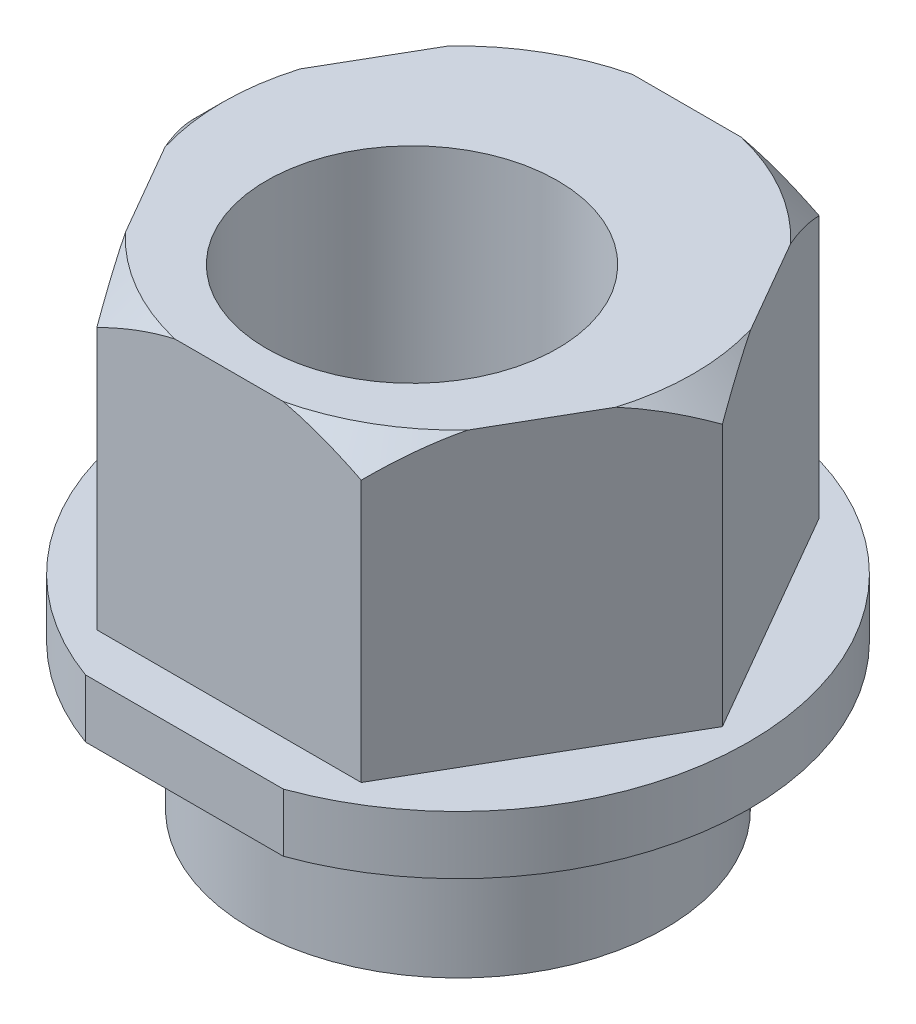
ISO-10303-21;
HEADER;
FILE_DESCRIPTION(('STEP AP214'),'2;1');
FILE_NAME('part.step','',(''),(''),'','','');
FILE_SCHEMA(('AUTOMOTIVE_DESIGN { 1 0 10303 214 1 1 1 1 }'));
ENDSEC;
DATA;
#1=APPLICATION_CONTEXT('core data for automotive mechanical design processes');
#2=APPLICATION_PROTOCOL_DEFINITION('international standard','automotive_design',2000,#1);
#3=PRODUCT_CONTEXT('',#1,'mechanical');
#4=PRODUCT('Part','Part','',(#3));
#5=PRODUCT_RELATED_PRODUCT_CATEGORY('part','',(#4));
#6=PRODUCT_DEFINITION_FORMATION('','',#4);
#7=PRODUCT_DEFINITION_CONTEXT('part definition',#1,'design');
#8=PRODUCT_DEFINITION('design','',#6,#7);
#9=PRODUCT_DEFINITION_SHAPE('','',#8);
#10=(LENGTH_UNIT() NAMED_UNIT(*) SI_UNIT(.MILLI.,.METRE.));
#11=(NAMED_UNIT(*) PLANE_ANGLE_UNIT() SI_UNIT($,.RADIAN.));
#12=(NAMED_UNIT(*) SI_UNIT($,.STERADIAN.) SOLID_ANGLE_UNIT());
#13=UNCERTAINTY_MEASURE_WITH_UNIT(LENGTH_MEASURE(1.E-05),#10,'distance_accuracy_value','');
#14=(GEOMETRIC_REPRESENTATION_CONTEXT(3) GLOBAL_UNCERTAINTY_ASSIGNED_CONTEXT((#13)) GLOBAL_UNIT_ASSIGNED_CONTEXT((#10,
#11,#12)) REPRESENTATION_CONTEXT('',''));
#15=CARTESIAN_POINT('',(0.,0.,0.));
#16=DIRECTION('',(0.,0.,1.));
#17=DIRECTION('',(1.,0.,0.));
#18=AXIS2_PLACEMENT_3D('',#15,#16,#17);
#19=CARTESIAN_POINT('',(0.,-1.,0.));
#20=DIRECTION('',(0.,1.,0.));
#21=DIRECTION('',(0.,0.,1.));
#22=AXIS2_PLACEMENT_3D('',#19,#20,#21);
#23=PLANE('',#22);
#24=CARTESIAN_POINT('',(0.,-1.,0.));
#25=DIRECTION('',(0.,1.,0.));
#26=DIRECTION('',(0.,0.,1.));
#27=AXIS2_PLACEMENT_3D('',#24,#25,#26);
#28=CIRCLE('',#27,5.);
#29=CARTESIAN_POINT('',(1.7,-1.,4.7021271782035));
#30=VERTEX_POINT('',#29);
#31=CARTESIAN_POINT('',(-1.7,-1.,4.7021271782035));
#32=VERTEX_POINT('',#31);
#33=EDGE_CURVE('E230',#30,#32,#28,.T.);
#34=ORIENTED_EDGE('',*,*,#33,.F.);
#35=DIRECTION('',(-1.,0.,0.));
#36=VECTOR('',#35,1.);
#37=CARTESIAN_POINT('',(0.,-1.,4.7021271782035));
#38=LINE('',#37,#36);
#39=EDGE_CURVE('E346',#30,#32,#38,.T.);
#40=ORIENTED_EDGE('',*,*,#39,.T.);
#41=EDGE_LOOP('',(#34,#40));
#42=FACE_BOUND('',#41,.T.);
#43=CARTESIAN_POINT('',(0.,-1.,0.));
#44=DIRECTION('',(0.,1.,0.));
#45=DIRECTION('',(0.,0.,1.));
#46=AXIS2_PLACEMENT_3D('',#43,#44,#45);
#47=CIRCLE('',#46,3.555);
#48=CARTESIAN_POINT('',(0.,-1.,3.555));
#49=VERTEX_POINT('',#48);
#50=EDGE_CURVE('E175',#49,#49,#47,.F.);
#51=ORIENTED_EDGE('',*,*,#50,.F.);
#52=EDGE_LOOP('',(#51));
#53=FACE_BOUND('',#52,.T.);
#54=ADVANCED_FACE('F43',(#42,#53),#23,.F.);
#55=CARTESIAN_POINT('',(2.27187330926118,5.,3.935));
#56=DIRECTION('',(-0.866025403784439,0.,-0.5));
#57=DIRECTION('',(-0.5,0.,0.866025403784439));
#58=AXIS2_PLACEMENT_3D('',#55,#56,#57);
#59=PLANE('',#58);
#60=DIRECTION('',(0.,-1.,0.));
#61=VECTOR('',#60,1.);
#62=CARTESIAN_POINT('',(4.54374661852235,5.,0.));
#63=LINE('',#62,#61);
#64=CARTESIAN_POINT('',(4.54374661852235,4.5,0.));
#65=VERTEX_POINT('',#64);
#66=CARTESIAN_POINT('',(4.54374661852235,0.,0.));
#67=VERTEX_POINT('',#66);
#68=EDGE_CURVE('E172',#65,#67,#63,.T.);
#69=ORIENTED_EDGE('',*,*,#68,.F.);
#70=CARTESIAN_POINT('',(6.12736327266163,2.33046829888115,-2.74290450468147));
#71=CARTESIAN_POINT('',(6.07348339276709,2.4177650828994,-2.64958181519841));
#72=CARTESIAN_POINT('',(6.01938921555573,2.50453762285222,-2.55588795187471));
#73=CARTESIAN_POINT('',(5.91069789973588,2.67683309661582,-2.36762907053321));
#74=CARTESIAN_POINT('',(5.85610071578471,2.76235591593962,-2.27306397397959));
#75=CARTESIAN_POINT('',(5.74620735938589,2.9321379387506,-2.08272309728255));
#76=CARTESIAN_POINT('',(5.6909098259844,3.01639362513631,-1.98694495989795));
#77=CARTESIAN_POINT('',(5.57966030231228,3.18315508159383,-1.79425513258));
#78=CARTESIAN_POINT('',(5.52370832991605,3.26566089928668,-1.69734347360602));
#79=CARTESIAN_POINT('',(5.40948255505868,3.43085092459455,-1.49949862801914));
#80=CARTESIAN_POINT('',(5.3511874452437,3.51347634106705,-1.3985285359868));
#81=CARTESIAN_POINT('',(5.23367321649109,3.67605365317037,-1.194987921175));
#82=CARTESIAN_POINT('',(5.17445413325307,3.75600565172091,-1.09241746022911));
#83=CARTESIAN_POINT('',(5.05499257757878,3.9125743398257,-0.885503976250002));
#84=CARTESIAN_POINT('',(4.99475102957391,3.98919384008597,-0.78116255437897));
#85=CARTESIAN_POINT('',(4.873034492307,4.1383918042904,-0.570343327711337));
#86=CARTESIAN_POINT('',(4.81155966257741,4.21097078637303,-0.463865799233039));
#87=CARTESIAN_POINT('',(4.68581480841085,4.35265115676022,-0.246069323026223));
#88=CARTESIAN_POINT('',(4.62151303943029,4.42164059850529,-0.134695392135335));
#89=CARTESIAN_POINT('',(4.4912183922476,4.55301635986169,0.090981556739347));
#90=CARTESIAN_POINT('',(4.42522527529575,4.61540174079966,0.205284988249787));
#91=CARTESIAN_POINT('',(4.29176890522431,4.73150823576122,0.436438201807242));
#92=CARTESIAN_POINT('',(4.22431561588303,4.78527468558276,0.553270726083977));
#93=CARTESIAN_POINT('',(4.08756303909753,4.88247623364584,0.790133137142428));
#94=CARTESIAN_POINT('',(4.01826431274338,4.92591443311341,0.910162052087628));
#95=CARTESIAN_POINT('',(3.89160680975576,4.99299560676046,1.129539282422));
#96=CARTESIAN_POINT('',(3.83454175212893,5.01884439579798,1.22837886156851));
#97=CARTESIAN_POINT('',(3.71955042243969,5.06126068823275,1.42754968702018));
#98=CARTESIAN_POINT('',(3.66162427680432,5.0778295405829,1.52788071434728));
#99=CARTESIAN_POINT('',(3.54536540774452,5.10083438466152,1.72924698238935));
#100=CARTESIAN_POINT('',(3.4870335640049,5.1072879053957,1.83028069944554));
#101=CARTESIAN_POINT('',(3.37031281221754,5.10976287991731,2.03244697183888));
#102=CARTESIAN_POINT('',(3.31192390350574,5.10578421082689,2.13357952832621));
#103=CARTESIAN_POINT('',(3.19571069696838,5.08764038060559,2.33486670655941));
#104=CARTESIAN_POINT('',(3.13788528988516,5.07350318473267,2.43502324959591));
#105=CARTESIAN_POINT('',(3.02300572590152,5.03579603444199,2.63400049116693));
#106=CARTESIAN_POINT('',(2.96595175572664,5.01222383709666,2.73282086628335));
#107=CARTESIAN_POINT('',(2.85271904802042,4.95661618256865,2.9289456691091));
#108=CARTESIAN_POINT('',(2.79654337792266,4.92455603960202,3.02624478386765));
#109=CARTESIAN_POINT('',(2.68537248742994,4.85318593152667,3.21879841452373));
#110=CARTESIAN_POINT('',(2.63037720983353,4.81387631861451,3.31405302949706));
#111=CARTESIAN_POINT('',(2.5019161833033,4.71383121159169,3.53655405423988));
#112=CARTESIAN_POINT('',(2.42896022795634,4.65048731772351,3.66291747561553));
#113=CARTESIAN_POINT('',(2.28511505424096,4.51496245516658,3.91206462491415));
#114=CARTESIAN_POINT('',(2.2142269607044,4.44277678394606,4.03484640457117));
#115=CARTESIAN_POINT('',(2.07416708594693,4.29140781010891,4.27743722375284));
#116=CARTESIAN_POINT('',(2.00499919286836,4.21221022636325,4.39723952881742));
#117=CARTESIAN_POINT('',(1.86828970424628,4.04847541244671,4.63402730898762));
#118=CARTESIAN_POINT('',(1.80074782327538,3.96393912900212,4.75101327846797));
#119=CARTESIAN_POINT('',(1.6667324101583,3.790255628053,4.9831347829841));
#120=CARTESIAN_POINT('',(1.60026513983173,3.70108917509827,5.09825947223014));
#121=CARTESIAN_POINT('',(1.46849790545969,3.51936003005431,5.32648701693534));
#122=CARTESIAN_POINT('',(1.40319803917282,3.42679705550268,5.43958970307165));
#123=CARTESIAN_POINT('',(1.27366225353528,3.23904020589262,5.66395226519422));
#124=CARTESIAN_POINT('',(1.20942525212282,3.14384930831284,5.77521401536649));
#125=CARTESIAN_POINT('',(1.08179181966025,2.9512386314917,5.99628160513605));
#126=CARTESIAN_POINT('',(1.01839540535985,2.85381880794148,6.10608741572204));
#127=CARTESIAN_POINT('',(0.910409016945997,2.6853578347565,6.2931253269807));
#128=CARTESIAN_POINT('',(0.865642352807006,2.61476846228915,6.3706634637548));
#129=CARTESIAN_POINT('',(0.776622094234247,2.47305833440251,6.52485107450574));
#130=CARTESIAN_POINT('',(0.732367142810404,2.40194099006958,6.60150289885833));
#131=CARTESIAN_POINT('',(0.688256655121896,2.33046829888115,6.67790450468147));
#132=B_SPLINE_CURVE_WITH_KNOTS('',3,(#70,#71,#72,#73,#74,#75,#76,#77,#78,#79,#80,#81,#82,#83,
#84,#85,#86,#87,#88,#89,#90,#91,#92,#93,#94,#95,#96,#97,#98,#99,#100,#101,#102,#103,#104,#105,
#106,#107,#108,#109,#110,#111,#112,#113,#114,#115,#116,#117,#118,#119,#120,#121,#122,#123,#124,
#125,#126,#127,#128,#129,#130,#131),.UNSPECIFIED.,.F.,.F.,(4,2,2,2,2,2,2,2,2,2,2,2,2,2,2,2,2,2,
2,2,2,2,2,2,2,2,2,2,2,2,4),(0.,0.416050988652375,0.832139855784054,1.24922530063749,
1.6662993802975,2.09496685038955,2.52361779884089,2.95189991005181,3.38012697311563,
3.81779500231414,4.25552515650994,4.69087140580247,5.12608676971888,5.4768138337239,
5.82748990199696,6.17755760407587,6.52762942952254,6.87674122143841,7.22593605499141,
7.5761578380004,7.92636261087879,8.40316579002672,8.88022366888807,9.35827656071276,
9.83624491486482,10.316388748245,10.7965726023688,11.2762330860941,11.7559031133002,
12.0979389750605,12.4385584137849),.UNSPECIFIED.);
#133=CARTESIAN_POINT('',(3.87355176865353,5.,1.1608115309438));
#134=VERTEX_POINT('',#133);
#135=EDGE_CURVE('E323',#65,#134,#132,.T.);
#136=ORIENTED_EDGE('',*,*,#135,.T.);
#137=DIRECTION('',(0.5,0.,-0.866025403784439));
#138=VECTOR('',#137,1.);
#139=CARTESIAN_POINT('',(2.27187330926118,5.,3.935));
#140=LINE('',#139,#138);
#141=CARTESIAN_POINT('',(2.94206815913,5.,2.7741884690562));
#142=VERTEX_POINT('',#141);
#143=EDGE_CURVE('E242',#142,#134,#140,.T.);
#144=ORIENTED_EDGE('',*,*,#143,.F.);
#145=CARTESIAN_POINT('',(2.27187330926118,4.5,3.935));
#146=VERTEX_POINT('',#145);
#147=EDGE_CURVE('E259',#142,#146,#132,.T.);
#148=ORIENTED_EDGE('',*,*,#147,.T.);
#149=DIRECTION('',(0.,-1.,0.));
#150=VECTOR('',#149,1.);
#151=CARTESIAN_POINT('',(2.27187330926118,5.,3.935));
#152=LINE('',#151,#150);
#153=CARTESIAN_POINT('',(2.27187330926118,0.,3.935));
#154=VERTEX_POINT('',#153);
#155=EDGE_CURVE('E226',#146,#154,#152,.T.);
#156=ORIENTED_EDGE('',*,*,#155,.T.);
#157=DIRECTION('',(0.5,0.,-0.866025403784439));
#158=VECTOR('',#157,1.);
#159=CARTESIAN_POINT('',(2.27187330926118,0.,3.935));
#160=LINE('',#159,#158);
#161=EDGE_CURVE('E227',#154,#67,#160,.T.);
#162=ORIENTED_EDGE('',*,*,#161,.T.);
#163=EDGE_LOOP('',(#69,#136,#144,#148,#156,#162));
#164=FACE_BOUND('',#163,.T.);
#165=ADVANCED_FACE('F45',(#164),#59,.F.);
#166=CARTESIAN_POINT('',(4.54374661852235,5.,0.));
#167=DIRECTION('',(-0.866025403784438,0.,0.5));
#168=DIRECTION('',(0.5,0.,0.866025403784438));
#169=AXIS2_PLACEMENT_3D('',#166,#167,#168);
#170=PLANE('',#169);
#171=DIRECTION('',(0.,-1.,0.));
#172=VECTOR('',#171,1.);
#173=CARTESIAN_POINT('',(2.27187330926118,5.,-3.935));
#174=LINE('',#173,#172);
#175=CARTESIAN_POINT('',(2.27187330926118,4.5,-3.935));
#176=VERTEX_POINT('',#175);
#177=CARTESIAN_POINT('',(2.27187330926118,0.,-3.935));
#178=VERTEX_POINT('',#177);
#179=EDGE_CURVE('E161',#176,#178,#174,.T.);
#180=ORIENTED_EDGE('',*,*,#179,.F.);
#181=CARTESIAN_POINT('',(0.688256655121894,2.33046829888116,-6.67790450468146));
#182=CARTESIAN_POINT('',(0.742136535016436,2.4177650828994,-6.58458181519841));
#183=CARTESIAN_POINT('',(0.796230712227795,2.50453762285222,-6.4908879518747));
#184=CARTESIAN_POINT('',(0.904922028047648,2.67683309661582,-6.3026290705332));
#185=CARTESIAN_POINT('',(0.959519211998818,2.76235591593963,-6.20806397397959));
#186=CARTESIAN_POINT('',(1.06941256839764,2.93213793875061,-6.01772309728255));
#187=CARTESIAN_POINT('',(1.12471010179913,3.01639362513632,-5.92194495989794));
#188=CARTESIAN_POINT('',(1.23595962547125,3.18315508159383,-5.72925513257999));
#189=CARTESIAN_POINT('',(1.29191159786749,3.26566089928668,-5.63234347360602));
#190=CARTESIAN_POINT('',(1.40613737272485,3.43085092459456,-5.43449862801913));
#191=CARTESIAN_POINT('',(1.46443248253983,3.51347634106706,-5.33352853598679));
#192=CARTESIAN_POINT('',(1.58194671129244,3.67605365317038,-5.12998792117499));
#193=CARTESIAN_POINT('',(1.64116579453046,3.75600565172092,-5.0274174602291));
#194=CARTESIAN_POINT('',(1.76062735020476,3.9125743398257,-4.82050397624999));
#195=CARTESIAN_POINT('',(1.82086889820963,3.98919384008598,-4.71616255437896));
#196=CARTESIAN_POINT('',(1.94258543547653,4.1383918042904,-4.50534332771133));
#197=CARTESIAN_POINT('',(2.00406026520612,4.21097078637303,-4.39886579923303));
#198=CARTESIAN_POINT('',(2.12980511937268,4.35265115676022,-4.18106932302621));
#199=CARTESIAN_POINT('',(2.19410688835324,4.4216405985053,-4.06969539213533));
#200=CARTESIAN_POINT('',(2.32440153553593,4.5530163598617,-3.84401844326064));
#201=CARTESIAN_POINT('',(2.39039465248778,4.61540174079966,-3.7297150117502));
#202=CARTESIAN_POINT('',(2.52385102255923,4.73150823576123,-3.49856179819275));
#203=CARTESIAN_POINT('',(2.5913043119005,4.78527468558276,-3.38172927391602));
#204=CARTESIAN_POINT('',(2.728056888686,4.88247623364584,-3.14486686285757));
#205=CARTESIAN_POINT('',(2.79735561504015,4.92591443311342,-3.02483794791237));
#206=CARTESIAN_POINT('',(2.92401311802778,4.99299560676046,-2.805460717578));
#207=CARTESIAN_POINT('',(2.98107817565461,5.01884439579799,-2.70662113843148));
#208=CARTESIAN_POINT('',(3.09606950534385,5.06126068823276,-2.50745031297981));
#209=CARTESIAN_POINT('',(3.15399565097922,5.0778295405829,-2.40711928565272));
#210=CARTESIAN_POINT('',(3.27025452003902,5.10083438466152,-2.20575301761065));
#211=CARTESIAN_POINT('',(3.32858636377864,5.1072879053957,-2.10471930055446));
#212=CARTESIAN_POINT('',(3.445307115566,5.10976287991731,-1.90255302816112));
#213=CARTESIAN_POINT('',(3.50369602427779,5.10578421082689,-1.80142047167379));
#214=CARTESIAN_POINT('',(3.61990923081515,5.08764038060559,-1.60013329344058));
#215=CARTESIAN_POINT('',(3.67773463789837,5.07350318473267,-1.49997675040409));
#216=CARTESIAN_POINT('',(3.79261420188202,5.03579603444199,-1.30099950883306));
#217=CARTESIAN_POINT('',(3.8496681720569,5.01222383709666,-1.20217913371665));
#218=CARTESIAN_POINT('',(3.96290087976311,4.95661618256865,-1.00605433089089));
#219=CARTESIAN_POINT('',(4.01907654986087,4.92455603960202,-0.908755216132345));
#220=CARTESIAN_POINT('',(4.13024744035359,4.85318593152667,-0.716201585476272));
#221=CARTESIAN_POINT('',(4.18524271795,4.81387631861451,-0.620946970502936));
#222=CARTESIAN_POINT('',(4.31370374448024,4.71383121159169,-0.398445945760117));
#223=CARTESIAN_POINT('',(4.38665969982719,4.6504873177235,-0.272082524384468));
#224=CARTESIAN_POINT('',(4.53050487354258,4.51496245516658,-0.0229353750858439));
#225=CARTESIAN_POINT('',(4.60139296707914,4.44277678394605,0.0998464045711766));
#226=CARTESIAN_POINT('',(4.74145284183661,4.2914078101089,0.342437223752842));
#227=CARTESIAN_POINT('',(4.81062073491518,4.21221022636324,0.462239528817422));
#228=CARTESIAN_POINT('',(4.94733022353726,4.0484754124467,0.699027308987622));
#229=CARTESIAN_POINT('',(5.01487210450815,3.96393912900211,0.81601327846798));
#230=CARTESIAN_POINT('',(5.14888751762524,3.79025562805299,1.04813478298411));
#231=CARTESIAN_POINT('',(5.21535478795181,3.70108917509827,1.16325947223014));
#232=CARTESIAN_POINT('',(5.34712202232385,3.5193600300543,1.39148701693534));
#233=CARTESIAN_POINT('',(5.41242188861072,3.42679705550267,1.50458970307166));
#234=CARTESIAN_POINT('',(5.54195767424825,3.23904020589262,1.72895226519422));
#235=CARTESIAN_POINT('',(5.60619467566072,3.14384930831283,1.84021401536649));
#236=CARTESIAN_POINT('',(5.73382810812329,2.95123863149169,2.06128160513606));
#237=CARTESIAN_POINT('',(5.79722452242369,2.85381880794147,2.17108741572204));
#238=CARTESIAN_POINT('',(5.90521091083754,2.68535783475649,2.3581253269807));
#239=CARTESIAN_POINT('',(5.94997757497653,2.61476846228915,2.43566346375481));
#240=CARTESIAN_POINT('',(6.03899783354929,2.47305833440251,2.58985107450574));
#241=CARTESIAN_POINT('',(6.08325278497313,2.40194099006958,2.66650289885833));
#242=CARTESIAN_POINT('',(6.12736327266164,2.33046829888115,2.74290450468146));
#243=B_SPLINE_CURVE_WITH_KNOTS('',3,(#181,#182,#183,#184,#185,#186,#187,#188,#189,#190,#191,
#192,#193,#194,#195,#196,#197,#198,#199,#200,#201,#202,#203,#204,#205,#206,#207,#208,#209,#210,
#211,#212,#213,#214,#215,#216,#217,#218,#219,#220,#221,#222,#223,#224,#225,#226,#227,#228,#229,
#230,#231,#232,#233,#234,#235,#236,#237,#238,#239,#240,#241,#242),.UNSPECIFIED.,.F.,.F.,(4,2,2,
2,2,2,2,2,2,2,2,2,2,2,2,2,2,2,2,2,2,2,2,2,2,2,2,2,2,2,4),(0.,0.416050988652376,
0.832139855784055,1.24922530063749,1.66629938029751,2.09496685038956,2.5236177988409,
2.95189991005182,3.38012697311563,3.81779500231415,4.25552515650994,4.69087140580247,
5.12608676971889,5.4768138337239,5.82748990199696,6.17755760407587,6.52762942952254,
6.87674122143841,7.22593605499141,7.57615783800039,7.92636261087879,8.40316579002672,
8.88022366888807,9.35827656071276,9.83624491486482,10.316388748245,10.7965726023688,
11.2762330860941,11.7559031133002,12.0979389750605,12.4385584137849),.UNSPECIFIED.);
#244=CARTESIAN_POINT('',(2.94206815913,5.,-2.7741884690562));
#245=VERTEX_POINT('',#244);
#246=EDGE_CURVE('E144',#176,#245,#243,.T.);
#247=ORIENTED_EDGE('',*,*,#246,.T.);
#248=DIRECTION('',(-0.5,0.,-0.866025403784438));
#249=VECTOR('',#248,1.);
#250=CARTESIAN_POINT('',(4.54374661852235,5.,0.));
#251=LINE('',#250,#249);
#252=CARTESIAN_POINT('',(3.87355176865353,5.,-1.1608115309438));
#253=VERTEX_POINT('',#252);
#254=EDGE_CURVE('E220',#253,#245,#251,.T.);
#255=ORIENTED_EDGE('',*,*,#254,.F.);
#256=EDGE_CURVE('E154',#253,#65,#243,.T.);
#257=ORIENTED_EDGE('',*,*,#256,.T.);
#258=ORIENTED_EDGE('',*,*,#68,.T.);
#259=DIRECTION('',(-0.5,0.,-0.866025403784438));
#260=VECTOR('',#259,1.);
#261=CARTESIAN_POINT('',(4.54374661852235,0.,0.));
#262=LINE('',#261,#260);
#263=EDGE_CURVE('E171',#67,#178,#262,.T.);
#264=ORIENTED_EDGE('',*,*,#263,.T.);
#265=EDGE_LOOP('',(#180,#247,#255,#257,#258,#264));
#266=FACE_BOUND('',#265,.T.);
#267=ADVANCED_FACE('F169',(#266),#170,.F.);
#268=CARTESIAN_POINT('',(2.27187330926118,5.,-3.935));
#269=DIRECTION('',(0.,0.,1.));
#270=DIRECTION('',(1.,0.,0.));
#271=AXIS2_PLACEMENT_3D('',#268,#269,#270);
#272=PLANE('',#271);
#273=DIRECTION('',(0.,-1.,0.));
#274=VECTOR('',#273,1.);
#275=CARTESIAN_POINT('',(-2.27187330926118,5.,-3.935));
#276=LINE('',#275,#274);
#277=CARTESIAN_POINT('',(-2.27187330926118,4.5,-3.935));
#278=VERTEX_POINT('',#277);
#279=CARTESIAN_POINT('',(-2.27187330926118,0.,-3.935));
#280=VERTEX_POINT('',#279);
#281=EDGE_CURVE('E173',#278,#280,#276,.T.);
#282=ORIENTED_EDGE('',*,*,#281,.F.);
#283=CARTESIAN_POINT('',(-5.01477781394264,2.6694057488158,-3.935));
#284=CARTESIAN_POINT('',(-4.90228240032233,2.75789162999437,-3.935));
#285=CARTESIAN_POINT('',(-4.78924605492269,2.84569863662638,-3.935));
#286=CARTESIAN_POINT('',(-4.56188241632701,3.01966288534844,-3.935));
#287=CARTESIAN_POINT('',(-4.44755491307628,3.10581985266844,-3.935));
#288=CARTESIAN_POINT('',(-4.21685222046402,3.27659538663721,-3.935));
#289=CARTESIAN_POINT('',(-4.10046957789372,3.36120391114583,-3.935));
#290=CARTESIAN_POINT('',(-3.86599418351296,3.52801066974508,-3.935));
#291=CARTESIAN_POINT('',(-3.74790151420127,3.61020901953759,-3.935));
#292=CARTESIAN_POINT('',(-3.50380543280417,3.77568927594522,-3.935));
#293=CARTESIAN_POINT('',(-3.3777005297054,3.85882204730453,-3.935));
#294=CARTESIAN_POINT('',(-3.12293409141574,4.0210686075328,-3.935));
#295=CARTESIAN_POINT('',(-2.99427277147477,4.10018273279293,-3.935));
#296=CARTESIAN_POINT('',(-2.7342134500717,4.25322326602883,-3.935));
#297=CARTESIAN_POINT('',(-2.60282112402671,4.32715926211431,-3.935));
#298=CARTESIAN_POINT('',(-2.33665993470769,4.46865096658867,-3.935));
#299=CARTESIAN_POINT('',(-2.20189200633557,4.53620841737975,-3.935));
#300=CARTESIAN_POINT('',(-1.94277039794665,4.65662539379787,-3.935));
#301=CARTESIAN_POINT('',(-1.81879024517606,4.7102827638368,-3.935));
#302=CARTESIAN_POINT('',(-1.56760322182998,4.80956431437058,-3.935));
#303=CARTESIAN_POINT('',(-1.4403960426367,4.8551877231961,-3.935));
#304=CARTESIAN_POINT('',(-1.18430895439847,4.93616339546024,-3.935));
#305=CARTESIAN_POINT('',(-1.05546474171029,4.97162701315895,-3.935));
#306=CARTESIAN_POINT('',(-0.795188728182397,5.03120060018271,-3.935));
#307=CARTESIAN_POINT('',(-0.663757985336443,5.05531511515621,-3.935));
#308=CARTESIAN_POINT('',(-0.39667530812576,5.09105643721047,-3.935));
#309=CARTESIAN_POINT('',(-0.260990364554486,5.10244193256667,-3.935));
#310=CARTESIAN_POINT('',(0.0108256286758382,5.11107629854814,-3.935));
#311=CARTESIAN_POINT('',(0.146956639108313,5.10832638056083,-3.935));
#312=CARTESIAN_POINT('',(0.418619878870053,5.08887050209526,-3.935));
#313=CARTESIAN_POINT('',(0.554148970208934,5.0721215602934,-3.935));
#314=CARTESIAN_POINT('',(0.822982454746628,5.02579152850102,-3.935));
#315=CARTESIAN_POINT('',(0.956286242224141,4.99620700199297,-3.935));
#316=CARTESIAN_POINT('',(1.26105655280132,4.91498323631563,-3.935));
#317=CARTESIAN_POINT('',(1.43144793684183,4.85934235740488,-3.935));
#318=CARTESIAN_POINT('',(1.76659971199313,4.73318715507506,-3.935));
#319=CARTESIAN_POINT('',(1.93135663408204,4.66266385383244,-3.935));
#320=CARTESIAN_POINT('',(2.25670464302017,4.50985567629177,-3.935));
#321=CARTESIAN_POINT('',(2.41725700907644,4.42748946751823,-3.935));
#322=CARTESIAN_POINT('',(2.7335996666453,4.25424890954647,-3.935));
#323=CARTESIAN_POINT('',(2.88939106725242,4.16337656225559,-3.935));
#324=CARTESIAN_POINT('',(3.2171018287942,3.96289685347115,-3.935));
#325=CARTESIAN_POINT('',(3.38846902004868,3.85239290462363,-3.935));
#326=CARTESIAN_POINT('',(3.7271209143155,3.62526903861077,-3.935));
#327=CARTESIAN_POINT('',(3.89440474117752,3.50864782550207,-3.935));
#328=CARTESIAN_POINT('',(4.22200861608271,3.27340163426143,-3.935));
#329=CARTESIAN_POINT('',(4.38240091884256,3.15487687320021,-3.935));
#330=CARTESIAN_POINT('',(4.6209837589724,2.97456068361506,-3.935));
#331=CARTESIAN_POINT('',(4.70015123515769,2.91405422097405,-3.935));
#332=CARTESIAN_POINT('',(4.85789331048121,2.79227931530866,-3.935));
#333=CARTESIAN_POINT('',(4.93646793238964,2.73101090179094,-3.935));
#334=CARTESIAN_POINT('',(5.01477781394264,2.6694057488158,-3.935));
#335=B_SPLINE_CURVE_WITH_KNOTS('',3,(#283,#284,#285,#286,#287,#288,#289,#290,#291,#292,#293,
#294,#295,#296,#297,#298,#299,#300,#301,#302,#303,#304,#305,#306,#307,#308,#309,#310,#311,#312,
#313,#314,#315,#316,#317,#318,#319,#320,#321,#322,#323,#324,#325,#326,#327,#328,#329,#330,#331,
#332,#333,#334),.UNSPECIFIED.,.F.,.F.,(4,2,2,2,2,2,2,2,2,2,2,2,2,2,2,2,2,2,2,2,2,2,2,2,2,4),(0.,
0.429382623340998,0.858836137877717,1.29047192805164,1.72208696325132,2.17515026344406,
2.62817557609088,3.08033856015113,3.53237766908385,3.9374314291705,4.34252407384557,
4.74299021725164,5.14329582542998,5.55106798246257,5.95880519450876,6.36779890408527,
6.77690218266532,7.31369645202257,7.85081547305105,8.39181700182992,8.932691525285,
9.54423171138721,10.15590197977,10.7541421331558,11.0530644250241,11.35197517691),.UNSPECIFIED.);
#336=CARTESIAN_POINT('',(-0.931483609523527,5.,-3.935));
#337=VERTEX_POINT('',#336);
#338=EDGE_CURVE('E166',#278,#337,#335,.T.);
#339=ORIENTED_EDGE('',*,*,#338,.T.);
#340=DIRECTION('',(-1.,0.,0.));
#341=VECTOR('',#340,1.);
#342=CARTESIAN_POINT('',(2.27187330926118,5.,-3.935));
#343=LINE('',#342,#341);
#344=CARTESIAN_POINT('',(0.931483609523526,5.,-3.935));
#345=VERTEX_POINT('',#344);
#346=EDGE_CURVE('E165',#345,#337,#343,.T.);
#347=ORIENTED_EDGE('',*,*,#346,.F.);
#348=EDGE_CURVE('E147',#345,#176,#335,.T.);
#349=ORIENTED_EDGE('',*,*,#348,.T.);
#350=ORIENTED_EDGE('',*,*,#179,.T.);
#351=DIRECTION('',(-1.,0.,0.));
#352=VECTOR('',#351,1.);
#353=CARTESIAN_POINT('',(2.27187330926118,0.,-3.935));
#354=LINE('',#353,#352);
#355=EDGE_CURVE('E232',#178,#280,#354,.T.);
#356=ORIENTED_EDGE('',*,*,#355,.T.);
#357=EDGE_LOOP('',(#282,#339,#347,#349,#350,#356));
#358=FACE_BOUND('',#357,.T.);
#359=ADVANCED_FACE('F159',(#358),#272,.F.);
#360=CARTESIAN_POINT('',(-2.27187330926118,5.,-3.935));
#361=DIRECTION('',(0.866025403784438,0.,0.5));
#362=DIRECTION('',(0.5,0.,-0.866025403784439));
#363=AXIS2_PLACEMENT_3D('',#360,#361,#362);
#364=PLANE('',#363);
#365=DIRECTION('',(0.,-1.,0.));
#366=VECTOR('',#365,1.);
#367=CARTESIAN_POINT('',(-4.54374661852235,5.,0.));
#368=LINE('',#367,#366);
#369=CARTESIAN_POINT('',(-4.54374661852235,4.5,0.));
#370=VERTEX_POINT('',#369);
#371=CARTESIAN_POINT('',(-4.54374661852235,0.,0.));
#372=VERTEX_POINT('',#371);
#373=EDGE_CURVE('E177',#370,#372,#368,.T.);
#374=ORIENTED_EDGE('',*,*,#373,.F.);
#375=CARTESIAN_POINT('',(-6.12736327266164,2.33046829888115,2.74290450468147));
#376=CARTESIAN_POINT('',(-6.07348339276709,2.4177650828994,2.64958181519841));
#377=CARTESIAN_POINT('',(-6.01938921555574,2.50453762285222,2.5558879518747));
#378=CARTESIAN_POINT('',(-5.91069789973588,2.67683309661582,2.3676290705332));
#379=CARTESIAN_POINT('',(-5.85610071578471,2.76235591593963,2.27306397397959));
#380=CARTESIAN_POINT('',(-5.74620735938589,2.9321379387506,2.08272309728255));
#381=CARTESIAN_POINT('',(-5.6909098259844,3.01639362513631,1.98694495989795));
#382=CARTESIAN_POINT('',(-5.57966030231228,3.18315508159383,1.79425513257999));
#383=CARTESIAN_POINT('',(-5.52370832991604,3.26566089928668,1.69734347360602));
#384=CARTESIAN_POINT('',(-5.40948255505868,3.43085092459455,1.49949862801913));
#385=CARTESIAN_POINT('',(-5.3511874452437,3.51347634106705,1.39852853598679));
#386=CARTESIAN_POINT('',(-5.23367321649109,3.67605365317037,1.19498792117499));
#387=CARTESIAN_POINT('',(-5.17445413325307,3.75600565172092,1.0924174602291));
#388=CARTESIAN_POINT('',(-5.05499257757878,3.9125743398257,0.885503976249998));
#389=CARTESIAN_POINT('',(-4.99475102957391,3.98919384008598,0.781162554378965));
#390=CARTESIAN_POINT('',(-4.873034492307,4.1383918042904,0.570343327711332));
#391=CARTESIAN_POINT('',(-4.81155966257741,4.21097078637303,0.463865799233036));
#392=CARTESIAN_POINT('',(-4.68581480841085,4.35265115676022,0.24606932302622));
#393=CARTESIAN_POINT('',(-4.62151303943029,4.42164059850529,0.134695392135332));
#394=CARTESIAN_POINT('',(-4.4912183922476,4.55301635986169,-0.0909815567393509));
#395=CARTESIAN_POINT('',(-4.42522527529575,4.61540174079966,-0.205284988249791));
#396=CARTESIAN_POINT('',(-4.2917689052243,4.73150823576122,-0.436438201807246));
#397=CARTESIAN_POINT('',(-4.22431561588303,4.78527468558276,-0.553270726083981));
#398=CARTESIAN_POINT('',(-4.08756303909753,4.88247623364584,-0.790133137142432));
#399=CARTESIAN_POINT('',(-4.01826431274338,4.92591443311341,-0.910162052087631));
#400=CARTESIAN_POINT('',(-3.89160680975576,4.99299560676046,-1.129539282422));
#401=CARTESIAN_POINT('',(-3.83454175212893,5.01884439579798,-1.22837886156851));
#402=CARTESIAN_POINT('',(-3.71955042243968,5.06126068823275,-1.42754968702018));
#403=CARTESIAN_POINT('',(-3.66162427680432,5.0778295405829,-1.52788071434728));
#404=CARTESIAN_POINT('',(-3.54536540774451,5.10083438466152,-1.72924698238935));
#405=CARTESIAN_POINT('',(-3.48703356400489,5.1072879053957,-1.83028069944554));
#406=CARTESIAN_POINT('',(-3.37031281221754,5.10976287991731,-2.03244697183888));
#407=CARTESIAN_POINT('',(-3.31192390350574,5.10578421082689,-2.13357952832621));
#408=CARTESIAN_POINT('',(-3.19571069696838,5.08764038060559,-2.33486670655941));
#409=CARTESIAN_POINT('',(-3.13788528988516,5.07350318473267,-2.43502324959591));
#410=CARTESIAN_POINT('',(-3.02300572590152,5.03579603444199,-2.63400049116693));
#411=CARTESIAN_POINT('',(-2.96595175572664,5.01222383709666,-2.73282086628335));
#412=CARTESIAN_POINT('',(-2.85271904802042,4.95661618256865,-2.9289456691091));
#413=CARTESIAN_POINT('',(-2.79654337792266,4.92455603960202,-3.02624478386765));
#414=CARTESIAN_POINT('',(-2.68537248742994,4.85318593152667,-3.21879841452372));
#415=CARTESIAN_POINT('',(-2.63037720983353,4.81387631861451,-3.31405302949706));
#416=CARTESIAN_POINT('',(-2.5019161833033,4.71383121159169,-3.53655405423988));
#417=CARTESIAN_POINT('',(-2.42896022795634,4.65048731772351,-3.66291747561553));
#418=CARTESIAN_POINT('',(-2.28511505424096,4.51496245516658,-3.91206462491415));
#419=CARTESIAN_POINT('',(-2.21422696070439,4.44277678394606,-4.03484640457117));
#420=CARTESIAN_POINT('',(-2.07416708594693,4.29140781010891,-4.27743722375283));
#421=CARTESIAN_POINT('',(-2.00499919286836,4.21221022636325,-4.39723952881741));
#422=CARTESIAN_POINT('',(-1.86828970424628,4.04847541244671,-4.63402730898761));
#423=CARTESIAN_POINT('',(-1.80074782327538,3.96393912900212,-4.75101327846797));
#424=CARTESIAN_POINT('',(-1.6667324101583,3.790255628053,-4.9831347829841));
#425=CARTESIAN_POINT('',(-1.60026513983173,3.70108917509828,-5.09825947223013));
#426=CARTESIAN_POINT('',(-1.46849790545969,3.51936003005432,-5.32648701693533));
#427=CARTESIAN_POINT('',(-1.40319803917282,3.42679705550269,-5.43958970307165));
#428=CARTESIAN_POINT('',(-1.27366225353529,3.23904020589263,-5.66395226519421));
#429=CARTESIAN_POINT('',(-1.20942525212282,3.14384930831284,-5.77521401536648));
#430=CARTESIAN_POINT('',(-1.08179181966026,2.95123863149171,-5.99628160513604));
#431=CARTESIAN_POINT('',(-1.01839540535985,2.85381880794148,-6.10608741572203));
#432=CARTESIAN_POINT('',(-0.910409016945998,2.68535783475651,-6.29312532698069));
#433=CARTESIAN_POINT('',(-0.865642352807006,2.61476846228916,-6.3706634637548));
#434=CARTESIAN_POINT('',(-0.776622094234247,2.47305833440251,-6.52485107450573));
#435=CARTESIAN_POINT('',(-0.732367142810403,2.40194099006959,-6.60150289885832));
#436=CARTESIAN_POINT('',(-0.688256655121894,2.33046829888116,-6.67790450468146));
#437=B_SPLINE_CURVE_WITH_KNOTS('',3,(#375,#376,#377,#378,#379,#380,#381,#382,#383,#384,#385,
#386,#387,#388,#389,#390,#391,#392,#393,#394,#395,#396,#397,#398,#399,#400,#401,#402,#403,#404,
#405,#406,#407,#408,#409,#410,#411,#412,#413,#414,#415,#416,#417,#418,#419,#420,#421,#422,#423,
#424,#425,#426,#427,#428,#429,#430,#431,#432,#433,#434,#435,#436),.UNSPECIFIED.,.F.,.F.,(4,2,2,
2,2,2,2,2,2,2,2,2,2,2,2,2,2,2,2,2,2,2,2,2,2,2,2,2,2,2,4),(0.,0.416050988652376,
0.832139855784055,1.24922530063749,1.66629938029751,2.09496685038956,2.5236177988409,
2.95189991005181,3.38012697311563,3.81779500231415,4.25552515650994,4.69087140580247,
5.12608676971889,5.4768138337239,5.82748990199696,6.17755760407587,6.52762942952254,
6.87674122143841,7.22593605499141,7.57615783800039,7.92636261087879,8.40316579002672,
8.88022366888806,9.35827656071275,9.83624491486481,10.316388748245,10.7965726023688,
11.276233086094,11.7559031133002,12.0979389750605,12.4385584137849),.UNSPECIFIED.);
#438=CARTESIAN_POINT('',(-3.87355176865353,5.,-1.1608115309438));
#439=VERTEX_POINT('',#438);
#440=EDGE_CURVE('E200',#370,#439,#437,.T.);
#441=ORIENTED_EDGE('',*,*,#440,.T.);
#442=DIRECTION('',(-0.5,0.,0.866025403784439));
#443=VECTOR('',#442,1.);
#444=CARTESIAN_POINT('',(-2.27187330926118,5.,-3.935));
#445=LINE('',#444,#443);
#446=CARTESIAN_POINT('',(-2.94206815913,5.,-2.7741884690562));
#447=VERTEX_POINT('',#446);
#448=EDGE_CURVE('E210',#447,#439,#445,.T.);
#449=ORIENTED_EDGE('',*,*,#448,.F.);
#450=EDGE_CURVE('E212',#447,#278,#437,.T.);
#451=ORIENTED_EDGE('',*,*,#450,.T.);
#452=ORIENTED_EDGE('',*,*,#281,.T.);
#453=DIRECTION('',(-0.5,0.,0.866025403784439));
#454=VECTOR('',#453,1.);
#455=CARTESIAN_POINT('',(-2.27187330926118,0.,-3.935));
#456=LINE('',#455,#454);
#457=EDGE_CURVE('E234',#280,#372,#456,.T.);
#458=ORIENTED_EDGE('',*,*,#457,.T.);
#459=EDGE_LOOP('',(#374,#441,#449,#451,#452,#458));
#460=FACE_BOUND('',#459,.T.);
#461=ADVANCED_FACE('F208',(#460),#364,.F.);
#462=CARTESIAN_POINT('',(-4.54374661852235,5.,0.));
#463=DIRECTION('',(0.866025403784438,0.,-0.5));
#464=DIRECTION('',(-0.5,0.,-0.866025403784439));
#465=AXIS2_PLACEMENT_3D('',#462,#463,#464);
#466=PLANE('',#465);
#467=DIRECTION('',(0.,-1.,0.));
#468=VECTOR('',#467,1.);
#469=CARTESIAN_POINT('',(-2.27187330926118,5.,3.935));
#470=LINE('',#469,#468);
#471=CARTESIAN_POINT('',(-2.27187330926118,4.5,3.935));
#472=VERTEX_POINT('',#471);
#473=CARTESIAN_POINT('',(-2.27187330926118,0.,3.935));
#474=VERTEX_POINT('',#473);
#475=EDGE_CURVE('E244',#472,#474,#470,.T.);
#476=ORIENTED_EDGE('',*,*,#475,.F.);
#477=CARTESIAN_POINT('',(-0.688256655121893,2.33046829888115,6.67790450468147));
#478=CARTESIAN_POINT('',(-0.742136535016436,2.4177650828994,6.58458181519841));
#479=CARTESIAN_POINT('',(-0.796230712227795,2.50453762285222,6.4908879518747));
#480=CARTESIAN_POINT('',(-0.904922028047647,2.67683309661582,6.3026290705332));
#481=CARTESIAN_POINT('',(-0.959519211998818,2.76235591593963,6.20806397397959));
#482=CARTESIAN_POINT('',(-1.06941256839764,2.9321379387506,6.01772309728255));
#483=CARTESIAN_POINT('',(-1.12471010179913,3.01639362513631,5.92194495989795));
#484=CARTESIAN_POINT('',(-1.23595962547125,3.18315508159383,5.72925513257999));
#485=CARTESIAN_POINT('',(-1.29191159786748,3.26566089928668,5.63234347360602));
#486=CARTESIAN_POINT('',(-1.40613737272485,3.43085092459455,5.43449862801913));
#487=CARTESIAN_POINT('',(-1.46443248253983,3.51347634106705,5.33352853598679));
#488=CARTESIAN_POINT('',(-1.58194671129244,3.67605365317037,5.12998792117499));
#489=CARTESIAN_POINT('',(-1.64116579453046,3.75600565172092,5.0274174602291));
#490=CARTESIAN_POINT('',(-1.76062735020475,3.9125743398257,4.82050397625));
#491=CARTESIAN_POINT('',(-1.82086889820962,3.98919384008598,4.71616255437897));
#492=CARTESIAN_POINT('',(-1.94258543547653,4.1383918042904,4.50534332771133));
#493=CARTESIAN_POINT('',(-2.00406026520612,4.21097078637303,4.39886579923304));
#494=CARTESIAN_POINT('',(-2.12980511937268,4.35265115676022,4.18106932302622));
#495=CARTESIAN_POINT('',(-2.19410688835324,4.42164059850529,4.06969539213533));
#496=CARTESIAN_POINT('',(-2.32440153553593,4.55301635986169,3.84401844326065));
#497=CARTESIAN_POINT('',(-2.39039465248778,4.61540174079966,3.72971501175021));
#498=CARTESIAN_POINT('',(-2.52385102255923,4.73150823576122,3.49856179819275));
#499=CARTESIAN_POINT('',(-2.5913043119005,4.78527468558276,3.38172927391602));
#500=CARTESIAN_POINT('',(-2.728056888686,4.88247623364584,3.14486686285757));
#501=CARTESIAN_POINT('',(-2.79735561504015,4.92591443311341,3.02483794791237));
#502=CARTESIAN_POINT('',(-2.92401311802777,4.99299560676046,2.805460717578));
#503=CARTESIAN_POINT('',(-2.9810781756546,5.01884439579798,2.70662113843149));
#504=CARTESIAN_POINT('',(-3.09606950534385,5.06126068823275,2.50745031297982));
#505=CARTESIAN_POINT('',(-3.15399565097921,5.0778295405829,2.40711928565272));
#506=CARTESIAN_POINT('',(-3.27025452003902,5.10083438466152,2.20575301761065));
#507=CARTESIAN_POINT('',(-3.32858636377864,5.1072879053957,2.10471930055446));
#508=CARTESIAN_POINT('',(-3.44530711556599,5.10976287991731,1.90255302816112));
#509=CARTESIAN_POINT('',(-3.50369602427779,5.10578421082689,1.80142047167379));
#510=CARTESIAN_POINT('',(-3.61990923081515,5.08764038060559,1.60013329344058));
#511=CARTESIAN_POINT('',(-3.67773463789837,5.07350318473267,1.49997675040409));
#512=CARTESIAN_POINT('',(-3.79261420188201,5.03579603444199,1.30099950883306));
#513=CARTESIAN_POINT('',(-3.84966817205689,5.01222383709666,1.20217913371665));
#514=CARTESIAN_POINT('',(-3.96290087976311,4.95661618256865,1.0060543308909));
#515=CARTESIAN_POINT('',(-4.01907654986087,4.92455603960202,0.908755216132348));
#516=CARTESIAN_POINT('',(-4.13024744035359,4.85318593152667,0.716201585476275));
#517=CARTESIAN_POINT('',(-4.18524271795,4.81387631861451,0.620946970502938));
#518=CARTESIAN_POINT('',(-4.31370374448024,4.71383121159169,0.39844594576012));
#519=CARTESIAN_POINT('',(-4.38665969982719,4.65048731772351,0.272082524384471));
#520=CARTESIAN_POINT('',(-4.53050487354258,4.51496245516658,0.0229353750858478));
#521=CARTESIAN_POINT('',(-4.60139296707914,4.44277678394605,-0.0998464045711718));
#522=CARTESIAN_POINT('',(-4.7414528418366,4.2914078101089,-0.342437223752836));
#523=CARTESIAN_POINT('',(-4.81062073491518,4.21221022636325,-0.462239528817416));
#524=CARTESIAN_POINT('',(-4.94733022353725,4.04847541244671,-0.699027308987616));
#525=CARTESIAN_POINT('',(-5.01487210450815,3.96393912900212,-0.816013278467974));
#526=CARTESIAN_POINT('',(-5.14888751762524,3.790255628053,-1.0481347829841));
#527=CARTESIAN_POINT('',(-5.21535478795181,3.70108917509827,-1.16325947223014));
#528=CARTESIAN_POINT('',(-5.34712202232384,3.51936003005431,-1.39148701693534));
#529=CARTESIAN_POINT('',(-5.41242188861071,3.42679705550268,-1.50458970307165));
#530=CARTESIAN_POINT('',(-5.54195767424825,3.23904020589263,-1.72895226519421));
#531=CARTESIAN_POINT('',(-5.60619467566072,3.14384930831284,-1.84021401536648));
#532=CARTESIAN_POINT('',(-5.73382810812328,2.9512386314917,-2.06128160513605));
#533=CARTESIAN_POINT('',(-5.79722452242368,2.85381880794148,-2.17108741572204));
#534=CARTESIAN_POINT('',(-5.90521091083754,2.6853578347565,-2.3581253269807));
#535=CARTESIAN_POINT('',(-5.94997757497653,2.61476846228915,-2.4356634637548));
#536=CARTESIAN_POINT('',(-6.03899783354928,2.47305833440251,-2.58985107450574));
#537=CARTESIAN_POINT('',(-6.08325278497313,2.40194099006958,-2.66650289885833));
#538=CARTESIAN_POINT('',(-6.12736327266164,2.33046829888115,-2.74290450468146));
#539=B_SPLINE_CURVE_WITH_KNOTS('',3,(#477,#478,#479,#480,#481,#482,#483,#484,#485,#486,#487,
#488,#489,#490,#491,#492,#493,#494,#495,#496,#497,#498,#499,#500,#501,#502,#503,#504,#505,#506,
#507,#508,#509,#510,#511,#512,#513,#514,#515,#516,#517,#518,#519,#520,#521,#522,#523,#524,#525,
#526,#527,#528,#529,#530,#531,#532,#533,#534,#535,#536,#537,#538),.UNSPECIFIED.,.F.,.F.,(4,2,2,
2,2,2,2,2,2,2,2,2,2,2,2,2,2,2,2,2,2,2,2,2,2,2,2,2,2,2,4),(0.,0.416050988652376,
0.832139855784055,1.24922530063749,1.66629938029751,2.09496685038956,2.5236177988409,
2.95189991005181,3.38012697311563,3.81779500231415,4.25552515650994,4.69087140580247,
5.12608676971889,5.4768138337239,5.82748990199696,6.17755760407587,6.52762942952254,
6.87674122143841,7.22593605499141,7.5761578380004,7.92636261087879,8.40316579002672,
8.88022366888807,9.35827656071275,9.83624491486482,10.316388748245,10.7965726023688,
11.2762330860941,11.7559031133002,12.0979389750605,12.4385584137849),.UNSPECIFIED.);
#540=CARTESIAN_POINT('',(-2.94206815913,5.,2.7741884690562));
#541=VERTEX_POINT('',#540);
#542=EDGE_CURVE('E265',#472,#541,#539,.T.);
#543=ORIENTED_EDGE('',*,*,#542,.T.);
#544=DIRECTION('',(0.5,0.,0.866025403784439));
#545=VECTOR('',#544,1.);
#546=CARTESIAN_POINT('',(-4.54374661852235,5.,0.));
#547=LINE('',#546,#545);
#548=CARTESIAN_POINT('',(-3.87355176865353,5.,1.16081153094381));
#549=VERTEX_POINT('',#548);
#550=EDGE_CURVE('E216',#549,#541,#547,.T.);
#551=ORIENTED_EDGE('',*,*,#550,.F.);
#552=EDGE_CURVE('E67',#549,#370,#539,.T.);
#553=ORIENTED_EDGE('',*,*,#552,.T.);
#554=ORIENTED_EDGE('',*,*,#373,.T.);
#555=DIRECTION('',(0.5,0.,0.866025403784439));
#556=VECTOR('',#555,1.);
#557=CARTESIAN_POINT('',(-4.54374661852235,0.,0.));
#558=LINE('',#557,#556);
#559=EDGE_CURVE('E236',#372,#474,#558,.T.);
#560=ORIENTED_EDGE('',*,*,#559,.T.);
#561=EDGE_LOOP('',(#476,#543,#551,#553,#554,#560));
#562=FACE_BOUND('',#561,.T.);
#563=ADVANCED_FACE('F248',(#562),#466,.F.);
#564=CARTESIAN_POINT('',(-2.27187330926118,5.,3.935));
#565=DIRECTION('',(0.,0.,-1.));
#566=DIRECTION('',(-1.,0.,0.));
#567=AXIS2_PLACEMENT_3D('',#564,#565,#566);
#568=PLANE('',#567);
#569=ORIENTED_EDGE('',*,*,#155,.F.);
#570=CARTESIAN_POINT('',(5.01477781394264,2.6694057488158,3.935));
#571=CARTESIAN_POINT('',(4.90228240032233,2.75789162999437,3.935));
#572=CARTESIAN_POINT('',(4.78924605492269,2.84569863662638,3.935));
#573=CARTESIAN_POINT('',(4.56188241632702,3.01966288534844,3.935));
#574=CARTESIAN_POINT('',(4.44755491307628,3.10581985266844,3.935));
#575=CARTESIAN_POINT('',(4.21685222046402,3.2765953866372,3.935));
#576=CARTESIAN_POINT('',(4.10046957789372,3.36120391114583,3.935));
#577=CARTESIAN_POINT('',(3.86599418351296,3.52801066974507,3.935));
#578=CARTESIAN_POINT('',(3.74790151420128,3.61020901953759,3.935));
#579=CARTESIAN_POINT('',(3.50380543280417,3.77568927594521,3.935));
#580=CARTESIAN_POINT('',(3.3777005297054,3.85882204730453,3.935));
#581=CARTESIAN_POINT('',(3.12293409141574,4.0210686075328,3.935));
#582=CARTESIAN_POINT('',(2.99427277147477,4.10018273279292,3.935));
#583=CARTESIAN_POINT('',(2.73421345007169,4.25322326602883,3.935));
#584=CARTESIAN_POINT('',(2.6028211240267,4.32715926211431,3.935));
#585=CARTESIAN_POINT('',(2.33665993470769,4.46865096658866,3.935));
#586=CARTESIAN_POINT('',(2.20189200633557,4.53620841737975,3.935));
#587=CARTESIAN_POINT('',(1.94277039794665,4.65662539379787,3.935));
#588=CARTESIAN_POINT('',(1.81879024517606,4.7102827638368,3.935));
#589=CARTESIAN_POINT('',(1.56760322182998,4.80956431437058,3.935));
#590=CARTESIAN_POINT('',(1.4403960426367,4.8551877231961,3.935));
#591=CARTESIAN_POINT('',(1.18430895439847,4.93616339546023,3.935));
#592=CARTESIAN_POINT('',(1.05546474171029,4.97162701315895,3.935));
#593=CARTESIAN_POINT('',(0.795188728182395,5.03120060018271,3.935));
#594=CARTESIAN_POINT('',(0.663757985336441,5.05531511515621,3.935));
#595=CARTESIAN_POINT('',(0.396675308125757,5.09105643721046,3.935));
#596=CARTESIAN_POINT('',(0.260990364554484,5.10244193256667,3.935));
#597=CARTESIAN_POINT('',(-0.0108256286758407,5.11107629854814,3.935));
#598=CARTESIAN_POINT('',(-0.146956639108315,5.10832638056083,3.935));
#599=CARTESIAN_POINT('',(-0.418619878870055,5.08887050209526,3.935));
#600=CARTESIAN_POINT('',(-0.554148970208936,5.07212156029339,3.935));
#601=CARTESIAN_POINT('',(-0.82298245474663,5.02579152850101,3.935));
#602=CARTESIAN_POINT('',(-0.956286242224143,4.99620700199297,3.935));
#603=CARTESIAN_POINT('',(-1.26105655280132,4.91498323631563,3.935));
#604=CARTESIAN_POINT('',(-1.43144793684184,4.85934235740488,3.935));
#605=CARTESIAN_POINT('',(-1.76659971199313,4.73318715507506,3.935));
#606=CARTESIAN_POINT('',(-1.93135663408205,4.66266385383244,3.935));
#607=CARTESIAN_POINT('',(-2.25670464302018,4.50985567629176,3.935));
#608=CARTESIAN_POINT('',(-2.41725700907645,4.42748946751823,3.935));
#609=CARTESIAN_POINT('',(-2.73359966664531,4.25424890954647,3.935));
#610=CARTESIAN_POINT('',(-2.88939106725242,4.16337656225559,3.935));
#611=CARTESIAN_POINT('',(-3.2171018287942,3.96289685347115,3.935));
#612=CARTESIAN_POINT('',(-3.38846902004868,3.85239290462363,3.935));
#613=CARTESIAN_POINT('',(-3.7271209143155,3.62526903861077,3.935));
#614=CARTESIAN_POINT('',(-3.89440474117752,3.50864782550207,3.935));
#615=CARTESIAN_POINT('',(-4.22200861608271,3.27340163426143,3.935));
#616=CARTESIAN_POINT('',(-4.38240091884256,3.15487687320021,3.935));
#617=CARTESIAN_POINT('',(-4.6209837589724,2.97456068361506,3.935));
#618=CARTESIAN_POINT('',(-4.70015123515769,2.91405422097405,3.935));
#619=CARTESIAN_POINT('',(-4.85789331048121,2.79227931530866,3.935));
#620=CARTESIAN_POINT('',(-4.93646793238964,2.73101090179094,3.935));
#621=CARTESIAN_POINT('',(-5.01477781394264,2.6694057488158,3.935));
#622=B_SPLINE_CURVE_WITH_KNOTS('',3,(#570,#571,#572,#573,#574,#575,#576,#577,#578,#579,#580,
#581,#582,#583,#584,#585,#586,#587,#588,#589,#590,#591,#592,#593,#594,#595,#596,#597,#598,#599,
#600,#601,#602,#603,#604,#605,#606,#607,#608,#609,#610,#611,#612,#613,#614,#615,#616,#617,#618,
#619,#620,#621),.UNSPECIFIED.,.F.,.F.,(4,2,2,2,2,2,2,2,2,2,2,2,2,2,2,2,2,2,2,2,2,2,2,2,2,4),(0.,
0.429382623340998,0.858836137877717,1.29047192805164,1.72208696325132,2.17515026344406,
2.62817557609088,3.08033856015113,3.53237766908385,3.93743142917051,4.34252407384557,
4.74299021725164,5.14329582542998,5.55106798246258,5.95880519450876,6.36779890408527,
6.77690218266532,7.31369645202258,7.85081547305105,8.39181700182993,8.93269152528501,
9.54423171138722,10.15590197977,10.7541421331558,11.0530644250241,11.35197517691),.UNSPECIFIED.);
#623=CARTESIAN_POINT('',(0.931483609523519,5.,3.935));
#624=VERTEX_POINT('',#623);
#625=EDGE_CURVE('E263',#146,#624,#622,.T.);
#626=ORIENTED_EDGE('',*,*,#625,.T.);
#627=DIRECTION('',(1.,0.,0.));
#628=VECTOR('',#627,1.);
#629=CARTESIAN_POINT('',(-2.27187330926118,5.,3.935));
#630=LINE('',#629,#628);
#631=CARTESIAN_POINT('',(-0.931483609523519,5.,3.935));
#632=VERTEX_POINT('',#631);
#633=EDGE_CURVE('E218',#632,#624,#630,.T.);
#634=ORIENTED_EDGE('',*,*,#633,.F.);
#635=EDGE_CURVE('E59',#632,#472,#622,.T.);
#636=ORIENTED_EDGE('',*,*,#635,.T.);
#637=ORIENTED_EDGE('',*,*,#475,.T.);
#638=DIRECTION('',(1.,0.,0.));
#639=VECTOR('',#638,1.);
#640=CARTESIAN_POINT('',(-2.27187330926118,0.,3.935));
#641=LINE('',#640,#639);
#642=EDGE_CURVE('E239',#474,#154,#641,.T.);
#643=ORIENTED_EDGE('',*,*,#642,.T.);
#644=EDGE_LOOP('',(#569,#626,#634,#636,#637,#643));
#645=FACE_BOUND('',#644,.T.);
#646=ADVANCED_FACE('F261',(#645),#568,.F.);
#647=CARTESIAN_POINT('',(0.,5.,0.));
#648=DIRECTION('',(0.,1.,0.));
#649=DIRECTION('',(0.,0.,1.));
#650=AXIS2_PLACEMENT_3D('',#647,#648,#649);
#651=PLANE('',#650);
#652=CARTESIAN_POINT('',(0.,5.,0.));
#653=DIRECTION('',(0.,1.,0.));
#654=DIRECTION('',(0.,0.,1.));
#655=AXIS2_PLACEMENT_3D('',#652,#653,#654);
#656=CIRCLE('',#655,4.04374661852235);
#657=EDGE_CURVE('E11',#632,#541,#656,.F.);
#658=ORIENTED_EDGE('',*,*,#657,.F.);
#659=ORIENTED_EDGE('',*,*,#633,.T.);
#660=EDGE_CURVE('E48',#142,#624,#656,.F.);
#661=ORIENTED_EDGE('',*,*,#660,.F.);
#662=ORIENTED_EDGE('',*,*,#143,.T.);
#663=EDGE_CURVE('E188',#253,#134,#656,.F.);
#664=ORIENTED_EDGE('',*,*,#663,.F.);
#665=ORIENTED_EDGE('',*,*,#254,.T.);
#666=CARTESIAN_POINT('',(0.,5.,0.));
#667=DIRECTION('',(0.,-1.,0.));
#668=DIRECTION('',(0.,0.,-1.));
#669=AXIS2_PLACEMENT_3D('',#666,#667,#668);
#670=CIRCLE('',#669,4.04374661852235);
#671=EDGE_CURVE('E149',#345,#245,#670,.T.);
#672=ORIENTED_EDGE('',*,*,#671,.F.);
#673=ORIENTED_EDGE('',*,*,#346,.T.);
#674=EDGE_CURVE('E192',#447,#337,#656,.F.);
#675=ORIENTED_EDGE('',*,*,#674,.F.);
#676=ORIENTED_EDGE('',*,*,#448,.T.);
#677=EDGE_CURVE('E53',#549,#439,#656,.F.);
#678=ORIENTED_EDGE('',*,*,#677,.F.);
#679=ORIENTED_EDGE('',*,*,#550,.T.);
#680=EDGE_LOOP('',(#658,#659,#661,#662,#664,#665,#672,#673,#675,#676,#678,#679));
#681=FACE_BOUND('',#680,.T.);
#682=CARTESIAN_POINT('',(0.,5.,0.79));
#683=DIRECTION('',(0.,1.,0.));
#684=DIRECTION('',(0.,0.,1.));
#685=AXIS2_PLACEMENT_3D('',#682,#683,#684);
#686=CIRCLE('',#685,2.5);
#687=CARTESIAN_POINT('',(0.,5.,3.29));
#688=VERTEX_POINT('',#687);
#689=EDGE_CURVE('E348',#688,#688,#686,.T.);
#690=ORIENTED_EDGE('',*,*,#689,.F.);
#691=EDGE_LOOP('',(#690));
#692=FACE_BOUND('',#691,.T.);
#693=ADVANCED_FACE('F214',(#681,#692),#651,.T.);
#694=CARTESIAN_POINT('',(0.,0.,0.));
#695=DIRECTION('',(0.,1.,0.));
#696=DIRECTION('',(0.,0.,1.));
#697=AXIS2_PLACEMENT_3D('',#694,#695,#696);
#698=PLANE('',#697);
#699=DIRECTION('',(-1.,0.,0.));
#700=VECTOR('',#699,1.);
#701=CARTESIAN_POINT('',(-1.7,0.,4.7021271782035));
#702=LINE('',#701,#700);
#703=CARTESIAN_POINT('',(1.7,0.,4.7021271782035));
#704=VERTEX_POINT('',#703);
#705=CARTESIAN_POINT('',(-1.7,0.,4.7021271782035));
#706=VERTEX_POINT('',#705);
#707=EDGE_CURVE('E344',#704,#706,#702,.T.);
#708=ORIENTED_EDGE('',*,*,#707,.F.);
#709=CARTESIAN_POINT('',(0.,0.,0.));
#710=DIRECTION('',(0.,1.,0.));
#711=DIRECTION('',(0.,0.,1.));
#712=AXIS2_PLACEMENT_3D('',#709,#710,#711);
#713=CIRCLE('',#712,5.);
#714=EDGE_CURVE('E357',#704,#706,#713,.T.);
#715=ORIENTED_EDGE('',*,*,#714,.T.);
#716=EDGE_LOOP('',(#708,#715));
#717=FACE_BOUND('',#716,.T.);
#718=ORIENTED_EDGE('',*,*,#161,.F.);
#719=ORIENTED_EDGE('',*,*,#642,.F.);
#720=ORIENTED_EDGE('',*,*,#559,.F.);
#721=ORIENTED_EDGE('',*,*,#457,.F.);
#722=ORIENTED_EDGE('',*,*,#355,.F.);
#723=ORIENTED_EDGE('',*,*,#263,.F.);
#724=EDGE_LOOP('',(#718,#719,#720,#721,#722,#723));
#725=FACE_BOUND('',#724,.T.);
#726=ADVANCED_FACE('F253',(#717,#725),#698,.T.);
#727=CARTESIAN_POINT('',(0.,-1.,0.));
#728=DIRECTION('',(0.,1.,0.));
#729=DIRECTION('',(0.,0.,1.));
#730=AXIS2_PLACEMENT_3D('',#727,#728,#729);
#731=CYLINDRICAL_SURFACE('',#730,5.);
#732=DIRECTION('',(0.,1.,0.));
#733=VECTOR('',#732,1.);
#734=CARTESIAN_POINT('',(-1.7,-1.,4.7021271782035));
#735=LINE('',#734,#733);
#736=EDGE_CURVE('E184',#706,#32,#735,.F.);
#737=ORIENTED_EDGE('',*,*,#736,.F.);
#738=ORIENTED_EDGE('',*,*,#714,.F.);
#739=DIRECTION('',(0.,1.,0.));
#740=VECTOR('',#739,1.);
#741=CARTESIAN_POINT('',(1.7,-1.,4.7021271782035));
#742=LINE('',#741,#740);
#743=EDGE_CURVE('E183',#30,#704,#742,.T.);
#744=ORIENTED_EDGE('',*,*,#743,.F.);
#745=ORIENTED_EDGE('',*,*,#33,.T.);
#746=EDGE_LOOP('',(#737,#738,#744,#745));
#747=FACE_BOUND('',#746,.T.);
#748=ADVANCED_FACE('F296',(#747),#731,.T.);
#749=CARTESIAN_POINT('',(0.,-3.5,0.));
#750=DIRECTION('',(0.,1.,0.));
#751=DIRECTION('',(0.,0.,1.));
#752=AXIS2_PLACEMENT_3D('',#749,#750,#751);
#753=CYLINDRICAL_SURFACE('',#752,3.555);
#754=CARTESIAN_POINT('',(0.,-3.5,0.));
#755=DIRECTION('',(0.,-1.,0.));
#756=DIRECTION('',(0.,0.,-1.));
#757=AXIS2_PLACEMENT_3D('',#754,#755,#756);
#758=CIRCLE('',#757,3.555);
#759=CARTESIAN_POINT('',(0.,-3.5,-3.555));
#760=VERTEX_POINT('',#759);
#761=EDGE_CURVE('E352',#760,#760,#758,.T.);
#762=ORIENTED_EDGE('',*,*,#761,.F.);
#763=EDGE_LOOP('',(#762));
#764=FACE_BOUND('',#763,.T.);
#765=ORIENTED_EDGE('',*,*,#50,.T.);
#766=EDGE_LOOP('',(#765));
#767=FACE_BOUND('',#766,.T.);
#768=ADVANCED_FACE('F293',(#764,#767),#753,.T.);
#769=CARTESIAN_POINT('',(0.,-3.5,0.));
#770=DIRECTION('',(0.,-1.,0.));
#771=DIRECTION('',(0.,0.,-1.));
#772=AXIS2_PLACEMENT_3D('',#769,#770,#771);
#773=PLANE('',#772);
#774=CARTESIAN_POINT('',(0.,-3.5,0.79));
#775=DIRECTION('',(0.,1.,0.));
#776=DIRECTION('',(0.,0.,1.));
#777=AXIS2_PLACEMENT_3D('',#774,#775,#776);
#778=CIRCLE('',#777,2.5);
#779=CARTESIAN_POINT('',(0.,-3.5,3.29));
#780=VERTEX_POINT('',#779);
#781=EDGE_CURVE('E349',#780,#780,#778,.T.);
#782=ORIENTED_EDGE('',*,*,#781,.T.);
#783=EDGE_LOOP('',(#782));
#784=FACE_BOUND('',#783,.T.);
#785=ORIENTED_EDGE('',*,*,#761,.T.);
#786=EDGE_LOOP('',(#785));
#787=FACE_BOUND('',#786,.T.);
#788=ADVANCED_FACE('F371',(#784,#787),#773,.T.);
#789=CARTESIAN_POINT('',(0.,-3.5,0.79));
#790=DIRECTION('',(0.,1.,0.));
#791=DIRECTION('',(0.,0.,1.));
#792=AXIS2_PLACEMENT_3D('',#789,#790,#791);
#793=CYLINDRICAL_SURFACE('',#792,2.5);
#794=ORIENTED_EDGE('',*,*,#781,.F.);
#795=EDGE_LOOP('',(#794));
#796=FACE_BOUND('',#795,.T.);
#797=ORIENTED_EDGE('',*,*,#689,.T.);
#798=EDGE_LOOP('',(#797));
#799=FACE_BOUND('',#798,.T.);
#800=ADVANCED_FACE('F368',(#796,#799),#793,.F.);
#801=CARTESIAN_POINT('',(-1.7,-3.5,4.7021271782035));
#802=DIRECTION('',(0.,0.,-1.));
#803=DIRECTION('',(-1.,0.,0.));
#804=AXIS2_PLACEMENT_3D('',#801,#802,#803);
#805=PLANE('',#804);
#806=ORIENTED_EDGE('',*,*,#743,.T.);
#807=ORIENTED_EDGE('',*,*,#707,.T.);
#808=ORIENTED_EDGE('',*,*,#736,.T.);
#809=ORIENTED_EDGE('',*,*,#39,.F.);
#810=EDGE_LOOP('',(#806,#807,#808,#809));
#811=FACE_BOUND('',#810,.T.);
#812=ADVANCED_FACE('F280',(#811),#805,.F.);
#813=CARTESIAN_POINT('',(0.,5.,0.));
#814=DIRECTION('',(0.,-1.,0.));
#815=DIRECTION('',(0.,0.,-1.));
#816=AXIS2_PLACEMENT_3D('',#813,#814,#815);
#817=CONICAL_SURFACE('',#816,4.04374661852235,0.785398163397448);
#818=ORIENTED_EDGE('',*,*,#660,.T.);
#819=ORIENTED_EDGE('',*,*,#625,.F.);
#820=ORIENTED_EDGE('',*,*,#147,.F.);
#821=EDGE_LOOP('',(#818,#819,#820));
#822=FACE_BOUND('',#821,.T.);
#823=ADVANCED_FACE('F271',(#822),#817,.T.);
#824=ORIENTED_EDGE('',*,*,#256,.F.);
#825=ORIENTED_EDGE('',*,*,#663,.T.);
#826=ORIENTED_EDGE('',*,*,#135,.F.);
#827=EDGE_LOOP('',(#824,#825,#826));
#828=FACE_BOUND('',#827,.T.);
#829=ADVANCED_FACE('F270',(#828),#817,.T.);
#830=ORIENTED_EDGE('',*,*,#348,.F.);
#831=ORIENTED_EDGE('',*,*,#671,.T.);
#832=ORIENTED_EDGE('',*,*,#246,.F.);
#833=EDGE_LOOP('',(#830,#831,#832));
#834=FACE_BOUND('',#833,.T.);
#835=ADVANCED_FACE('F146',(#834),#817,.T.);
#836=ORIENTED_EDGE('',*,*,#450,.F.);
#837=ORIENTED_EDGE('',*,*,#674,.T.);
#838=ORIENTED_EDGE('',*,*,#338,.F.);
#839=EDGE_LOOP('',(#836,#837,#838));
#840=FACE_BOUND('',#839,.T.);
#841=ADVANCED_FACE('F275',(#840),#817,.T.);
#842=ORIENTED_EDGE('',*,*,#552,.F.);
#843=ORIENTED_EDGE('',*,*,#677,.T.);
#844=ORIENTED_EDGE('',*,*,#440,.F.);
#845=EDGE_LOOP('',(#842,#843,#844));
#846=FACE_BOUND('',#845,.T.);
#847=ADVANCED_FACE('F199',(#846),#817,.T.);
#848=ORIENTED_EDGE('',*,*,#635,.F.);
#849=ORIENTED_EDGE('',*,*,#657,.T.);
#850=ORIENTED_EDGE('',*,*,#542,.F.);
#851=EDGE_LOOP('',(#848,#849,#850));
#852=FACE_BOUND('',#851,.T.);
#853=ADVANCED_FACE('F267',(#852),#817,.T.);
#854=CLOSED_SHELL('',(#54,#165,#267,#359,#461,#563,#646,#693,#726,#748,#768,#788,#800,#812,#823,
#829,#835,#841,#847,#853));
#855=MANIFOLD_SOLID_BREP('B2',#854);
#856=ADVANCED_BREP_SHAPE_REPRESENTATION('',(#18,#855),#14);
#857=SHAPE_DEFINITION_REPRESENTATION(#9,#856);
ENDSEC;
END-ISO-10303-21;
